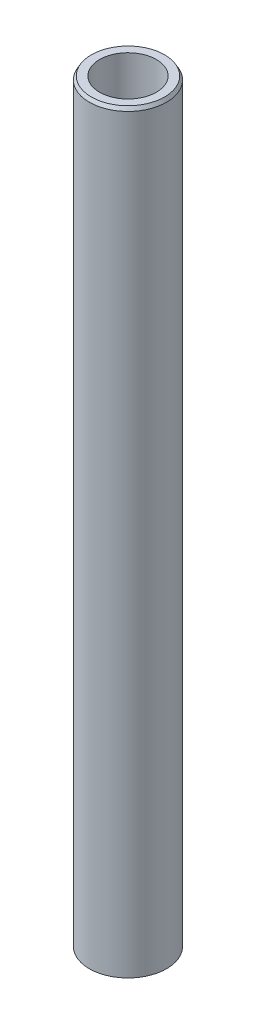
ISO-10303-21;
HEADER;
FILE_DESCRIPTION(('STEP AP214'),'2;1');
FILE_NAME('part.step','',(''),(''),'','','');
FILE_SCHEMA(('AUTOMOTIVE_DESIGN { 1 0 10303 214 1 1 1 1 }'));
ENDSEC;
DATA;
#1=APPLICATION_CONTEXT('core data for automotive mechanical design processes');
#2=APPLICATION_PROTOCOL_DEFINITION('international standard','automotive_design',2000,#1);
#3=PRODUCT_CONTEXT('',#1,'mechanical');
#4=PRODUCT('Part','Part','',(#3));
#5=PRODUCT_RELATED_PRODUCT_CATEGORY('part','',(#4));
#6=PRODUCT_DEFINITION_FORMATION('','',#4);
#7=PRODUCT_DEFINITION_CONTEXT('part definition',#1,'design');
#8=PRODUCT_DEFINITION('design','',#6,#7);
#9=PRODUCT_DEFINITION_SHAPE('','',#8);
#10=(LENGTH_UNIT() NAMED_UNIT(*) SI_UNIT(.MILLI.,.METRE.));
#11=(NAMED_UNIT(*) PLANE_ANGLE_UNIT() SI_UNIT($,.RADIAN.));
#12=(NAMED_UNIT(*) SI_UNIT($,.STERADIAN.) SOLID_ANGLE_UNIT());
#13=UNCERTAINTY_MEASURE_WITH_UNIT(LENGTH_MEASURE(1.E-05),#10,'distance_accuracy_value','');
#14=(GEOMETRIC_REPRESENTATION_CONTEXT(3) GLOBAL_UNCERTAINTY_ASSIGNED_CONTEXT((#13)) GLOBAL_UNIT_ASSIGNED_CONTEXT((#10,
#11,#12)) REPRESENTATION_CONTEXT('',''));
#15=CARTESIAN_POINT('',(0.,0.,0.));
#16=DIRECTION('',(0.,0.,1.));
#17=DIRECTION('',(1.,0.,0.));
#18=AXIS2_PLACEMENT_3D('',#15,#16,#17);
#19=CARTESIAN_POINT('',(0.,489.247888927678,0.));
#20=DIRECTION('',(0.,-1.,0.));
#21=DIRECTION('',(0.,0.,-1.));
#22=AXIS2_PLACEMENT_3D('',#19,#20,#21);
#23=CYLINDRICAL_SURFACE('',#22,25.);
#24=CARTESIAN_POINT('',(0.,486.971942275683,0.));
#25=DIRECTION('',(0.,1.,0.));
#26=DIRECTION('',(0.,0.,1.));
#27=AXIS2_PLACEMENT_3D('',#24,#25,#26);
#28=CIRCLE('',#27,25.);
#29=CARTESIAN_POINT('',(0.,486.971942275683,25.));
#30=VERTEX_POINT('',#29);
#31=EDGE_CURVE('E50',#30,#30,#28,.F.);
#32=ORIENTED_EDGE('',*,*,#31,.T.);
#33=EDGE_LOOP('',(#32));
#34=FACE_BOUND('',#33,.T.);
#35=CARTESIAN_POINT('',(0.,1.31401841219037,0.));
#36=DIRECTION('',(0.,1.,0.));
#37=DIRECTION('',(0.,0.,1.));
#38=AXIS2_PLACEMENT_3D('',#35,#36,#37);
#39=CIRCLE('',#38,25.);
#40=CARTESIAN_POINT('',(0.,1.31401841219037,25.));
#41=VERTEX_POINT('',#40);
#42=EDGE_CURVE('E51',#41,#41,#39,.T.);
#43=ORIENTED_EDGE('',*,*,#42,.T.);
#44=EDGE_LOOP('',(#43));
#45=FACE_BOUND('',#44,.T.);
#46=ADVANCED_FACE('F39',(#34,#45),#23,.T.);
#47=CARTESIAN_POINT('',(0.,489.247888927678,0.));
#48=DIRECTION('',(0.,1.,0.));
#49=DIRECTION('',(0.,0.,1.));
#50=AXIS2_PLACEMENT_3D('',#47,#48,#49);
#51=PLANE('',#50);
#52=CARTESIAN_POINT('',(0.,489.247888927678,0.));
#53=DIRECTION('',(0.,1.,0.));
#54=DIRECTION('',(0.,0.,1.));
#55=AXIS2_PLACEMENT_3D('',#52,#53,#54);
#56=CIRCLE('',#55,23.6859815878097);
#57=CARTESIAN_POINT('',(0.,489.247888927678,23.6859815878097));
#58=VERTEX_POINT('',#57);
#59=EDGE_CURVE('E54',#58,#58,#56,.T.);
#60=ORIENTED_EDGE('',*,*,#59,.T.);
#61=EDGE_LOOP('',(#60));
#62=FACE_BOUND('',#61,.T.);
#63=CARTESIAN_POINT('',(0.,489.247888927678,0.));
#64=DIRECTION('',(0.,1.,0.));
#65=DIRECTION('',(0.,0.,1.));
#66=AXIS2_PLACEMENT_3D('',#63,#64,#65);
#67=CIRCLE('',#66,18.3746837229983);
#68=CARTESIAN_POINT('',(0.,489.247888927678,18.3746837229983));
#69=VERTEX_POINT('',#68);
#70=EDGE_CURVE('E58',#69,#69,#67,.T.);
#71=ORIENTED_EDGE('',*,*,#70,.F.);
#72=EDGE_LOOP('',(#71));
#73=FACE_BOUND('',#72,.T.);
#74=ADVANCED_FACE('F69',(#62,#73),#51,.T.);
#75=CARTESIAN_POINT('',(0.,0.,0.));
#76=DIRECTION('',(0.,1.,0.));
#77=DIRECTION('',(0.,0.,1.));
#78=AXIS2_PLACEMENT_3D('',#75,#76,#77);
#79=PLANE('',#78);
#80=CARTESIAN_POINT('',(0.,0.,0.));
#81=DIRECTION('',(0.,1.,0.));
#82=DIRECTION('',(0.,0.,1.));
#83=AXIS2_PLACEMENT_3D('',#80,#81,#82);
#84=CIRCLE('',#83,22.7240533480053);
#85=CARTESIAN_POINT('',(0.,0.,22.7240533480053));
#86=VERTEX_POINT('',#85);
#87=EDGE_CURVE('E10',#86,#86,#84,.F.);
#88=ORIENTED_EDGE('',*,*,#87,.T.);
#89=EDGE_LOOP('',(#88));
#90=FACE_BOUND('',#89,.T.);
#91=CARTESIAN_POINT('',(0.,0.,0.));
#92=DIRECTION('',(0.,1.,0.));
#93=DIRECTION('',(0.,0.,1.));
#94=AXIS2_PLACEMENT_3D('',#91,#92,#93);
#95=CIRCLE('',#94,18.3746837229983);
#96=CARTESIAN_POINT('',(0.,0.,18.3746837229983));
#97=VERTEX_POINT('',#96);
#98=EDGE_CURVE('E63',#97,#97,#95,.T.);
#99=ORIENTED_EDGE('',*,*,#98,.T.);
#100=EDGE_LOOP('',(#99));
#101=FACE_BOUND('',#100,.T.);
#102=ADVANCED_FACE('F75',(#90,#101),#79,.F.);
#103=CARTESIAN_POINT('',(0.,489.247888927678,0.));
#104=DIRECTION('',(0.,-1.,0.));
#105=DIRECTION('',(0.,0.,-1.));
#106=AXIS2_PLACEMENT_3D('',#103,#104,#105);
#107=CYLINDRICAL_SURFACE('',#106,18.3746837229983);
#108=ORIENTED_EDGE('',*,*,#70,.T.);
#109=EDGE_LOOP('',(#108));
#110=FACE_BOUND('',#109,.T.);
#111=ORIENTED_EDGE('',*,*,#98,.F.);
#112=EDGE_LOOP('',(#111));
#113=FACE_BOUND('',#112,.T.);
#114=ADVANCED_FACE('F70',(#110,#113),#107,.F.);
#115=CARTESIAN_POINT('',(0.,489.247888927678,0.));
#116=DIRECTION('',(0.,-1.,0.));
#117=DIRECTION('',(0.,0.,-1.));
#118=AXIS2_PLACEMENT_3D('',#115,#116,#117);
#119=CONICAL_SURFACE('',#118,23.6859815878097,0.523598775598282);
#120=ORIENTED_EDGE('',*,*,#31,.F.);
#121=EDGE_LOOP('',(#120));
#122=FACE_BOUND('',#121,.T.);
#123=ORIENTED_EDGE('',*,*,#59,.F.);
#124=EDGE_LOOP('',(#123));
#125=FACE_BOUND('',#124,.T.);
#126=ADVANCED_FACE('F81',(#122,#125),#119,.T.);
#127=CARTESIAN_POINT('',(0.,1.31401841219037,0.));
#128=DIRECTION('',(0.,1.,0.));
#129=DIRECTION('',(0.,0.,1.));
#130=AXIS2_PLACEMENT_3D('',#127,#128,#129);
#131=CONICAL_SURFACE('',#130,25.,1.04719755119661);
#132=ORIENTED_EDGE('',*,*,#87,.F.);
#133=EDGE_LOOP('',(#132));
#134=FACE_BOUND('',#133,.T.);
#135=ORIENTED_EDGE('',*,*,#42,.F.);
#136=EDGE_LOOP('',(#135));
#137=FACE_BOUND('',#136,.T.);
#138=ADVANCED_FACE('F45',(#134,#137),#131,.T.);
#139=CLOSED_SHELL('',(#46,#74,#102,#114,#126,#138));
#140=MANIFOLD_SOLID_BREP('B2',#139);
#141=ADVANCED_BREP_SHAPE_REPRESENTATION('',(#18,#140),#14);
#142=SHAPE_DEFINITION_REPRESENTATION(#9,#141);
ENDSEC;
END-ISO-10303-21;
